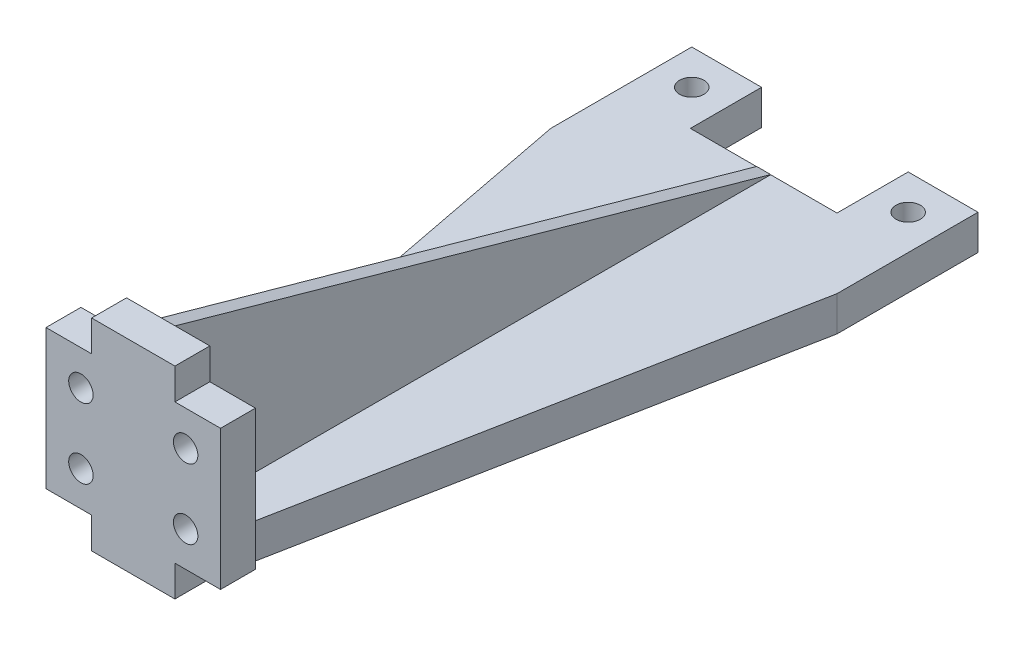
ISO-10303-21;
HEADER;
FILE_DESCRIPTION(('STEP AP214'),'2;1');
FILE_NAME('part.step','',(''),(''),'','','');
FILE_SCHEMA(('AUTOMOTIVE_DESIGN { 1 0 10303 214 1 1 1 1 }'));
ENDSEC;
DATA;
#1=APPLICATION_CONTEXT('core data for automotive mechanical design processes');
#2=APPLICATION_PROTOCOL_DEFINITION('international standard','automotive_design',2000,#1);
#3=PRODUCT_CONTEXT('',#1,'mechanical');
#4=PRODUCT('Part','Part','',(#3));
#5=PRODUCT_RELATED_PRODUCT_CATEGORY('part','',(#4));
#6=PRODUCT_DEFINITION_FORMATION('','',#4);
#7=PRODUCT_DEFINITION_CONTEXT('part definition',#1,'design');
#8=PRODUCT_DEFINITION('design','',#6,#7);
#9=PRODUCT_DEFINITION_SHAPE('','',#8);
#10=(LENGTH_UNIT() NAMED_UNIT(*) SI_UNIT(.MILLI.,.METRE.));
#11=(NAMED_UNIT(*) PLANE_ANGLE_UNIT() SI_UNIT($,.RADIAN.));
#12=(NAMED_UNIT(*) SI_UNIT($,.STERADIAN.) SOLID_ANGLE_UNIT());
#13=UNCERTAINTY_MEASURE_WITH_UNIT(LENGTH_MEASURE(1.E-05),#10,'distance_accuracy_value','');
#14=(GEOMETRIC_REPRESENTATION_CONTEXT(3) GLOBAL_UNCERTAINTY_ASSIGNED_CONTEXT((#13)) GLOBAL_UNIT_ASSIGNED_CONTEXT((#10,
#11,#12)) REPRESENTATION_CONTEXT('',''));
#15=CARTESIAN_POINT('',(0.,0.,0.));
#16=DIRECTION('',(0.,0.,1.));
#17=DIRECTION('',(1.,0.,0.));
#18=AXIS2_PLACEMENT_3D('',#15,#16,#17);
#19=CARTESIAN_POINT('',(25.5,0.,0.));
#20=DIRECTION('',(-0.981875388359621,0.,-0.189527627890089));
#21=DIRECTION('',(-0.189527627890089,0.,0.981875388359621));
#22=AXIS2_PLACEMENT_3D('',#19,#20,#21);
#23=PLANE('',#22);
#24=DIRECTION('',(0.,1.,0.));
#25=VECTOR('',#24,1.);
#26=CARTESIAN_POINT('',(26.4651307596513,-9.01387818865998,-5.));
#27=LINE('',#26,#25);
#28=CARTESIAN_POINT('',(26.4651307596513,0.,-5.));
#29=VERTEX_POINT('',#28);
#30=CARTESIAN_POINT('',(26.4651307596513,4.45,-5.));
#31=VERTEX_POINT('',#30);
#32=EDGE_CURVE('E325',#29,#31,#27,.T.);
#33=ORIENTED_EDGE('',*,*,#32,.F.);
#34=DIRECTION('',(-0.189527627890089,0.,0.981875388359621));
#35=VECTOR('',#34,1.);
#36=CARTESIAN_POINT('',(25.5,0.,0.));
#37=LINE('',#36,#35);
#38=CARTESIAN_POINT('',(41.,0.,-80.3));
#39=VERTEX_POINT('',#38);
#40=EDGE_CURVE('E393',#39,#29,#37,.T.);
#41=ORIENTED_EDGE('',*,*,#40,.F.);
#42=DIRECTION('',(0.,1.,0.));
#43=VECTOR('',#42,1.);
#44=CARTESIAN_POINT('',(41.,0.,-80.3));
#45=LINE('',#44,#43);
#46=CARTESIAN_POINT('',(41.,5.,-80.3));
#47=VERTEX_POINT('',#46);
#48=EDGE_CURVE('E388',#39,#47,#45,.T.);
#49=ORIENTED_EDGE('',*,*,#48,.T.);
#50=DIRECTION('',(-0.189527627890089,0.,0.981875388359621));
#51=VECTOR('',#50,1.);
#52=CARTESIAN_POINT('',(25.5,5.,0.));
#53=LINE('',#52,#51);
#54=CARTESIAN_POINT('',(26.4651307596513,5.,-5.));
#55=VERTEX_POINT('',#54);
#56=EDGE_CURVE('E376',#47,#55,#53,.T.);
#57=ORIENTED_EDGE('',*,*,#56,.T.);
#58=EDGE_CURVE('E330',#31,#55,#27,.T.);
#59=ORIENTED_EDGE('',*,*,#58,.F.);
#60=EDGE_LOOP('',(#33,#41,#49,#57,#59));
#61=FACE_BOUND('',#60,.T.);
#62=ADVANCED_FACE('F41',(#61),#23,.F.);
#63=CARTESIAN_POINT('',(0.,5.,0.));
#64=DIRECTION('',(0.,-1.,0.));
#65=DIRECTION('',(0.,0.,-1.));
#66=AXIS2_PLACEMENT_3D('',#63,#64,#65);
#67=PLANE('',#66);
#68=DIRECTION('',(0.,0.,-1.));
#69=VECTOR('',#68,1.);
#70=CARTESIAN_POINT('',(41.,5.,0.));
#71=LINE('',#70,#69);
#72=CARTESIAN_POINT('',(41.,5.,-100.5));
#73=VERTEX_POINT('',#72);
#74=EDGE_CURVE('E460',#47,#73,#71,.T.);
#75=ORIENTED_EDGE('',*,*,#74,.T.);
#76=DIRECTION('',(-1.,0.,0.));
#77=VECTOR('',#76,1.);
#78=CARTESIAN_POINT('',(0.,5.,-100.5));
#79=LINE('',#78,#77);
#80=CARTESIAN_POINT('',(31.,5.,-100.5));
#81=VERTEX_POINT('',#80);
#82=EDGE_CURVE('E465',#73,#81,#79,.T.);
#83=ORIENTED_EDGE('',*,*,#82,.T.);
#84=DIRECTION('',(0.,0.,-1.));
#85=VECTOR('',#84,1.);
#86=CARTESIAN_POINT('',(31.,5.,-100.5));
#87=LINE('',#86,#85);
#88=CARTESIAN_POINT('',(31.,5.,-90.3));
#89=VERTEX_POINT('',#88);
#90=EDGE_CURVE('E436',#89,#81,#87,.T.);
#91=ORIENTED_EDGE('',*,*,#90,.F.);
#92=DIRECTION('',(1.,0.,0.));
#93=VECTOR('',#92,1.);
#94=CARTESIAN_POINT('',(10.,5.,-90.3));
#95=LINE('',#94,#93);
#96=CARTESIAN_POINT('',(21.5,5.,-90.3));
#97=VERTEX_POINT('',#96);
#98=EDGE_CURVE('E406',#97,#89,#95,.T.);
#99=ORIENTED_EDGE('',*,*,#98,.F.);
#100=DIRECTION('',(0.,0.,-1.));
#101=VECTOR('',#100,1.);
#102=CARTESIAN_POINT('',(21.5,5.,-90.3));
#103=LINE('',#102,#101);
#104=CARTESIAN_POINT('',(21.5,5.,-5.));
#105=VERTEX_POINT('',#104);
#106=EDGE_CURVE('E351',#105,#97,#103,.T.);
#107=ORIENTED_EDGE('',*,*,#106,.F.);
#108=DIRECTION('',(-1.,0.,0.));
#109=VECTOR('',#108,1.);
#110=CARTESIAN_POINT('',(14.5348692403487,5.,-5.));
#111=LINE('',#110,#109);
#112=EDGE_CURVE('E377',#55,#105,#111,.T.);
#113=ORIENTED_EDGE('',*,*,#112,.F.);
#114=ORIENTED_EDGE('',*,*,#56,.F.);
#115=EDGE_LOOP('',(#75,#83,#91,#99,#107,#113,#114));
#116=FACE_BOUND('',#115,.T.);
#117=CARTESIAN_POINT('',(36.,5.,-95.5));
#118=DIRECTION('',(0.,1.,0.));
#119=DIRECTION('',(0.,0.,1.));
#120=AXIS2_PLACEMENT_3D('',#117,#118,#119);
#121=CIRCLE('',#120,1.75);
#122=CARTESIAN_POINT('',(36.,5.,-93.75));
#123=VERTEX_POINT('',#122);
#124=EDGE_CURVE('E392',#123,#123,#121,.T.);
#125=ORIENTED_EDGE('',*,*,#124,.F.);
#126=EDGE_LOOP('',(#125));
#127=FACE_BOUND('',#126,.T.);
#128=ADVANCED_FACE('F506',(#116,#127),#67,.F.);
#129=CARTESIAN_POINT('',(5.,5.,-95.5));
#130=DIRECTION('',(0.,1.,0.));
#131=DIRECTION('',(0.,0.,1.));
#132=AXIS2_PLACEMENT_3D('',#129,#130,#131);
#133=CIRCLE('',#132,1.75);
#134=CARTESIAN_POINT('',(5.,5.,-93.75));
#135=VERTEX_POINT('',#134);
#136=EDGE_CURVE('E407',#135,#135,#133,.T.);
#137=ORIENTED_EDGE('',*,*,#136,.F.);
#138=EDGE_LOOP('',(#137));
#139=FACE_BOUND('',#138,.T.);
#140=DIRECTION('',(0.,0.,1.));
#141=VECTOR('',#140,1.);
#142=CARTESIAN_POINT('',(19.5,5.,-90.3));
#143=LINE('',#142,#141);
#144=CARTESIAN_POINT('',(19.5,5.,-90.3));
#145=VERTEX_POINT('',#144);
#146=CARTESIAN_POINT('',(19.5,5.,-5.));
#147=VERTEX_POINT('',#146);
#148=EDGE_CURVE('E348',#145,#147,#143,.T.);
#149=ORIENTED_EDGE('',*,*,#148,.F.);
#150=CARTESIAN_POINT('',(10.,5.,-90.3));
#151=VERTEX_POINT('',#150);
#152=EDGE_CURVE('E432',#151,#145,#95,.T.);
#153=ORIENTED_EDGE('',*,*,#152,.F.);
#154=DIRECTION('',(0.,0.,1.));
#155=VECTOR('',#154,1.);
#156=CARTESIAN_POINT('',(10.,5.,-100.5));
#157=LINE('',#156,#155);
#158=CARTESIAN_POINT('',(10.,5.,-100.5));
#159=VERTEX_POINT('',#158);
#160=EDGE_CURVE('E423',#159,#151,#157,.T.);
#161=ORIENTED_EDGE('',*,*,#160,.F.);
#162=CARTESIAN_POINT('',(0.,5.,-100.5));
#163=VERTEX_POINT('',#162);
#164=EDGE_CURVE('E464',#159,#163,#79,.T.);
#165=ORIENTED_EDGE('',*,*,#164,.T.);
#166=DIRECTION('',(0.,0.,1.));
#167=VECTOR('',#166,1.);
#168=CARTESIAN_POINT('',(0.,5.,0.));
#169=LINE('',#168,#167);
#170=CARTESIAN_POINT('',(0.,5.,-80.3));
#171=VERTEX_POINT('',#170);
#172=EDGE_CURVE('E456',#163,#171,#169,.T.);
#173=ORIENTED_EDGE('',*,*,#172,.T.);
#174=DIRECTION('',(-0.189527627890089,0.,-0.981875388359621));
#175=VECTOR('',#174,1.);
#176=CARTESIAN_POINT('',(15.5,5.,0.));
#177=LINE('',#176,#175);
#178=CARTESIAN_POINT('',(14.5348692403487,5.,-5.));
#179=VERTEX_POINT('',#178);
#180=EDGE_CURVE('E385',#179,#171,#177,.T.);
#181=ORIENTED_EDGE('',*,*,#180,.F.);
#182=EDGE_CURVE('E368',#147,#179,#111,.T.);
#183=ORIENTED_EDGE('',*,*,#182,.F.);
#184=EDGE_LOOP('',(#149,#153,#161,#165,#173,#181,#183));
#185=FACE_BOUND('',#184,.T.);
#186=ADVANCED_FACE('F548',(#139,#185),#67,.F.);
#187=CARTESIAN_POINT('',(14.5348692403487,28.9,-5.));
#188=DIRECTION('',(0.,0.,1.));
#189=DIRECTION('',(1.,0.,0.));
#190=AXIS2_PLACEMENT_3D('',#187,#188,#189);
#191=PLANE('',#190);
#192=CARTESIAN_POINT('',(28.,19.45,-5.));
#193=DIRECTION('',(0.,0.,1.));
#194=DIRECTION('',(1.,0.,0.));
#195=AXIS2_PLACEMENT_3D('',#192,#193,#194);
#196=CIRCLE('',#195,1.75);
#197=CARTESIAN_POINT('',(29.75,19.45,-5.));
#198=VERTEX_POINT('',#197);
#199=EDGE_CURVE('E239',#198,#198,#196,.T.);
#200=ORIENTED_EDGE('',*,*,#199,.T.);
#201=EDGE_LOOP('',(#200));
#202=FACE_BOUND('',#201,.T.);
#203=CARTESIAN_POINT('',(28.,9.45,-5.));
#204=DIRECTION('',(0.,0.,1.));
#205=DIRECTION('',(1.,0.,0.));
#206=AXIS2_PLACEMENT_3D('',#203,#204,#205);
#207=CIRCLE('',#206,1.75);
#208=CARTESIAN_POINT('',(29.75,9.45,-5.));
#209=VERTEX_POINT('',#208);
#210=EDGE_CURVE('E922',#209,#209,#207,.T.);
#211=ORIENTED_EDGE('',*,*,#210,.T.);
#212=EDGE_LOOP('',(#211));
#213=FACE_BOUND('',#212,.T.);
#214=DIRECTION('',(0.,1.,0.));
#215=VECTOR('',#214,1.);
#216=CARTESIAN_POINT('',(33.,-9.01387818865998,-5.));
#217=LINE('',#216,#215);
#218=CARTESIAN_POINT('',(33.,4.45,-5.));
#219=VERTEX_POINT('',#218);
#220=CARTESIAN_POINT('',(33.,24.45,-5.));
#221=VERTEX_POINT('',#220);
#222=EDGE_CURVE('E331',#219,#221,#217,.T.);
#223=ORIENTED_EDGE('',*,*,#222,.F.);
#224=DIRECTION('',(1.,0.,0.));
#225=VECTOR('',#224,1.);
#226=CARTESIAN_POINT('',(26.4651307596513,4.45,-5.));
#227=LINE('',#226,#225);
#228=EDGE_CURVE('E57',#31,#219,#227,.T.);
#229=ORIENTED_EDGE('',*,*,#228,.F.);
#230=ORIENTED_EDGE('',*,*,#58,.T.);
#231=ORIENTED_EDGE('',*,*,#112,.T.);
#232=DIRECTION('',(0.,-1.,0.));
#233=VECTOR('',#232,1.);
#234=CARTESIAN_POINT('',(21.5,114.223443437311,-5.));
#235=LINE('',#234,#233);
#236=CARTESIAN_POINT('',(21.5,28.9,-5.));
#237=VERTEX_POINT('',#236);
#238=EDGE_CURVE('E361',#237,#105,#235,.T.);
#239=ORIENTED_EDGE('',*,*,#238,.F.);
#240=DIRECTION('',(-1.,0.,0.));
#241=VECTOR('',#240,1.);
#242=CARTESIAN_POINT('',(14.5348692403487,28.9,-5.));
#243=LINE('',#242,#241);
#244=CARTESIAN_POINT('',(26.4651307596513,28.9,-5.));
#245=VERTEX_POINT('',#244);
#246=EDGE_CURVE('E369',#245,#237,#243,.T.);
#247=ORIENTED_EDGE('',*,*,#246,.F.);
#248=DIRECTION('',(0.,1.,0.));
#249=VECTOR('',#248,1.);
#250=CARTESIAN_POINT('',(26.4651307596513,28.9,-5.));
#251=LINE('',#250,#249);
#252=CARTESIAN_POINT('',(26.4651307596513,24.45,-5.));
#253=VERTEX_POINT('',#252);
#254=EDGE_CURVE('E234',#253,#245,#251,.T.);
#255=ORIENTED_EDGE('',*,*,#254,.F.);
#256=DIRECTION('',(-1.,0.,0.));
#257=VECTOR('',#256,1.);
#258=CARTESIAN_POINT('',(33.,24.45,-5.));
#259=LINE('',#258,#257);
#260=EDGE_CURVE('E211',#221,#253,#259,.T.);
#261=ORIENTED_EDGE('',*,*,#260,.F.);
#262=EDGE_LOOP('',(#223,#229,#230,#231,#239,#247,#255,#261));
#263=FACE_BOUND('',#262,.T.);
#264=ADVANCED_FACE('F571',(#202,#213,#263),#191,.F.);
#265=CARTESIAN_POINT('',(13.,9.45,-5.));
#266=DIRECTION('',(0.,0.,1.));
#267=DIRECTION('',(1.,0.,0.));
#268=AXIS2_PLACEMENT_3D('',#265,#266,#267);
#269=CIRCLE('',#268,1.75);
#270=CARTESIAN_POINT('',(14.75,9.45,-5.));
#271=VERTEX_POINT('',#270);
#272=EDGE_CURVE('E937',#271,#271,#269,.T.);
#273=ORIENTED_EDGE('',*,*,#272,.T.);
#274=EDGE_LOOP('',(#273));
#275=FACE_BOUND('',#274,.T.);
#276=CARTESIAN_POINT('',(13.,19.45,-5.));
#277=DIRECTION('',(0.,0.,1.));
#278=DIRECTION('',(1.,0.,0.));
#279=AXIS2_PLACEMENT_3D('',#276,#277,#278);
#280=CIRCLE('',#279,1.75);
#281=CARTESIAN_POINT('',(14.75,19.45,-5.));
#282=VERTEX_POINT('',#281);
#283=EDGE_CURVE('E938',#282,#282,#280,.T.);
#284=ORIENTED_EDGE('',*,*,#283,.T.);
#285=EDGE_LOOP('',(#284));
#286=FACE_BOUND('',#285,.T.);
#287=DIRECTION('',(0.,1.,0.));
#288=VECTOR('',#287,1.);
#289=CARTESIAN_POINT('',(8.00000000000001,-9.01387818865998,-5.));
#290=LINE('',#289,#288);
#291=CARTESIAN_POINT('',(8.00000000000001,4.45,-5.));
#292=VERTEX_POINT('',#291);
#293=CARTESIAN_POINT('',(8.00000000000001,24.45,-5.));
#294=VERTEX_POINT('',#293);
#295=EDGE_CURVE('E307',#292,#294,#290,.T.);
#296=ORIENTED_EDGE('',*,*,#295,.T.);
#297=DIRECTION('',(-1.,0.,0.));
#298=VECTOR('',#297,1.);
#299=CARTESIAN_POINT('',(8.00000000000001,24.45,-5.));
#300=LINE('',#299,#298);
#301=CARTESIAN_POINT('',(14.5348692403487,24.45,-5.));
#302=VERTEX_POINT('',#301);
#303=EDGE_CURVE('E273',#302,#294,#300,.T.);
#304=ORIENTED_EDGE('',*,*,#303,.F.);
#305=DIRECTION('',(0.,-1.,0.));
#306=VECTOR('',#305,1.);
#307=CARTESIAN_POINT('',(14.5348692403487,28.9,-5.));
#308=LINE('',#307,#306);
#309=CARTESIAN_POINT('',(14.5348692403487,28.9,-5.));
#310=VERTEX_POINT('',#309);
#311=EDGE_CURVE('E245',#310,#302,#308,.T.);
#312=ORIENTED_EDGE('',*,*,#311,.F.);
#313=CARTESIAN_POINT('',(19.5,28.9,-5.));
#314=VERTEX_POINT('',#313);
#315=EDGE_CURVE('E373',#314,#310,#243,.T.);
#316=ORIENTED_EDGE('',*,*,#315,.F.);
#317=DIRECTION('',(0.,-1.,0.));
#318=VECTOR('',#317,1.);
#319=CARTESIAN_POINT('',(19.5,114.223443437311,-5.));
#320=LINE('',#319,#318);
#321=EDGE_CURVE('E364',#314,#147,#320,.T.);
#322=ORIENTED_EDGE('',*,*,#321,.T.);
#323=ORIENTED_EDGE('',*,*,#182,.T.);
#324=DIRECTION('',(0.,1.,0.));
#325=VECTOR('',#324,1.);
#326=CARTESIAN_POINT('',(14.5348692403487,-9.01387818865998,-5.));
#327=LINE('',#326,#325);
#328=CARTESIAN_POINT('',(14.5348692403487,4.45,-5.));
#329=VERTEX_POINT('',#328);
#330=EDGE_CURVE('E317',#329,#179,#327,.T.);
#331=ORIENTED_EDGE('',*,*,#330,.F.);
#332=DIRECTION('',(1.,0.,0.));
#333=VECTOR('',#332,1.);
#334=CARTESIAN_POINT('',(8.00000000000001,4.45,-5.));
#335=LINE('',#334,#333);
#336=EDGE_CURVE('E262',#292,#329,#335,.T.);
#337=ORIENTED_EDGE('',*,*,#336,.F.);
#338=EDGE_LOOP('',(#296,#304,#312,#316,#322,#323,#331,#337));
#339=FACE_BOUND('',#338,.T.);
#340=ADVANCED_FACE('F549',(#275,#286,#339),#191,.F.);
#341=CARTESIAN_POINT('',(0.,5.,-100.5));
#342=DIRECTION('',(0.,0.,1.));
#343=DIRECTION('',(1.,0.,0.));
#344=AXIS2_PLACEMENT_3D('',#341,#342,#343);
#345=PLANE('',#344);
#346=ORIENTED_EDGE('',*,*,#164,.F.);
#347=DIRECTION('',(0.,1.,0.));
#348=VECTOR('',#347,1.);
#349=CARTESIAN_POINT('',(10.,0.,-100.5));
#350=LINE('',#349,#348);
#351=CARTESIAN_POINT('',(10.,0.,-100.5));
#352=VERTEX_POINT('',#351);
#353=EDGE_CURVE('E446',#352,#159,#350,.T.);
#354=ORIENTED_EDGE('',*,*,#353,.F.);
#355=DIRECTION('',(-1.,0.,0.));
#356=VECTOR('',#355,1.);
#357=CARTESIAN_POINT('',(0.,0.,-100.5));
#358=LINE('',#357,#356);
#359=CARTESIAN_POINT('',(0.,0.,-100.5));
#360=VERTEX_POINT('',#359);
#361=EDGE_CURVE('E480',#352,#360,#358,.T.);
#362=ORIENTED_EDGE('',*,*,#361,.T.);
#363=DIRECTION('',(0.,-1.,0.));
#364=VECTOR('',#363,1.);
#365=CARTESIAN_POINT('',(0.,5.,-100.5));
#366=LINE('',#365,#364);
#367=EDGE_CURVE('E469',#163,#360,#366,.T.);
#368=ORIENTED_EDGE('',*,*,#367,.F.);
#369=EDGE_LOOP('',(#346,#354,#362,#368));
#370=FACE_BOUND('',#369,.T.);
#371=ADVANCED_FACE('F563',(#370),#345,.F.);
#372=CARTESIAN_POINT('',(0.,5.,0.));
#373=DIRECTION('',(1.,0.,0.));
#374=DIRECTION('',(0.,0.,-1.));
#375=AXIS2_PLACEMENT_3D('',#372,#373,#374);
#376=PLANE('',#375);
#377=DIRECTION('',(0.,0.,1.));
#378=VECTOR('',#377,1.);
#379=CARTESIAN_POINT('',(0.,0.,0.));
#380=LINE('',#379,#378);
#381=CARTESIAN_POINT('',(0.,0.,-80.3));
#382=VERTEX_POINT('',#381);
#383=EDGE_CURVE('E445',#360,#382,#380,.T.);
#384=ORIENTED_EDGE('',*,*,#383,.T.);
#385=DIRECTION('',(0.,1.,0.));
#386=VECTOR('',#385,1.);
#387=CARTESIAN_POINT('',(0.,0.,-80.3));
#388=LINE('',#387,#386);
#389=EDGE_CURVE('E384',#382,#171,#388,.T.);
#390=ORIENTED_EDGE('',*,*,#389,.T.);
#391=ORIENTED_EDGE('',*,*,#172,.F.);
#392=ORIENTED_EDGE('',*,*,#367,.T.);
#393=EDGE_LOOP('',(#384,#390,#391,#392));
#394=FACE_BOUND('',#393,.T.);
#395=ADVANCED_FACE('F43',(#394),#376,.F.);
#396=CARTESIAN_POINT('',(0.,5.,0.));
#397=DIRECTION('',(0.,0.,-1.));
#398=DIRECTION('',(-1.,0.,0.));
#399=AXIS2_PLACEMENT_3D('',#396,#397,#398);
#400=PLANE('',#399);
#401=CARTESIAN_POINT('',(28.,19.45,0.));
#402=DIRECTION('',(0.,0.,1.));
#403=DIRECTION('',(1.,0.,0.));
#404=AXIS2_PLACEMENT_3D('',#401,#402,#403);
#405=CIRCLE('',#404,1.75);
#406=CARTESIAN_POINT('',(29.75,19.45,0.));
#407=VERTEX_POINT('',#406);
#408=EDGE_CURVE('E950',#407,#407,#405,.T.);
#409=ORIENTED_EDGE('',*,*,#408,.F.);
#410=EDGE_LOOP('',(#409));
#411=FACE_BOUND('',#410,.T.);
#412=CARTESIAN_POINT('',(13.,9.45,0.));
#413=DIRECTION('',(0.,0.,1.));
#414=DIRECTION('',(1.,0.,0.));
#415=AXIS2_PLACEMENT_3D('',#412,#413,#414);
#416=CIRCLE('',#415,1.75);
#417=CARTESIAN_POINT('',(14.75,9.45,0.));
#418=VERTEX_POINT('',#417);
#419=EDGE_CURVE('E951',#418,#418,#416,.T.);
#420=ORIENTED_EDGE('',*,*,#419,.F.);
#421=EDGE_LOOP('',(#420));
#422=FACE_BOUND('',#421,.T.);
#423=CARTESIAN_POINT('',(28.,9.45,0.));
#424=DIRECTION('',(0.,0.,1.));
#425=DIRECTION('',(1.,0.,0.));
#426=AXIS2_PLACEMENT_3D('',#423,#424,#425);
#427=CIRCLE('',#426,1.75);
#428=CARTESIAN_POINT('',(29.75,9.45,0.));
#429=VERTEX_POINT('',#428);
#430=EDGE_CURVE('E955',#429,#429,#427,.T.);
#431=ORIENTED_EDGE('',*,*,#430,.F.);
#432=EDGE_LOOP('',(#431));
#433=FACE_BOUND('',#432,.T.);
#434=CARTESIAN_POINT('',(13.,19.45,0.));
#435=DIRECTION('',(0.,0.,1.));
#436=DIRECTION('',(1.,0.,0.));
#437=AXIS2_PLACEMENT_3D('',#434,#435,#436);
#438=CIRCLE('',#437,1.75);
#439=CARTESIAN_POINT('',(14.75,19.45,0.));
#440=VERTEX_POINT('',#439);
#441=EDGE_CURVE('E944',#440,#440,#438,.T.);
#442=ORIENTED_EDGE('',*,*,#441,.F.);
#443=EDGE_LOOP('',(#442));
#444=FACE_BOUND('',#443,.T.);
#445=DIRECTION('',(0.,1.,0.));
#446=VECTOR('',#445,1.);
#447=CARTESIAN_POINT('',(26.4651307596513,0.,0.));
#448=LINE('',#447,#446);
#449=CARTESIAN_POINT('',(26.4651307596513,0.,0.));
#450=VERTEX_POINT('',#449);
#451=CARTESIAN_POINT('',(26.4651307596513,4.45,0.));
#452=VERTEX_POINT('',#451);
#453=EDGE_CURVE('E249',#450,#452,#448,.T.);
#454=ORIENTED_EDGE('',*,*,#453,.T.);
#455=DIRECTION('',(1.,0.,0.));
#456=VECTOR('',#455,1.);
#457=CARTESIAN_POINT('',(26.4651307596513,4.45,0.));
#458=LINE('',#457,#456);
#459=CARTESIAN_POINT('',(33.,4.45,0.));
#460=VERTEX_POINT('',#459);
#461=EDGE_CURVE('E252',#452,#460,#458,.T.);
#462=ORIENTED_EDGE('',*,*,#461,.T.);
#463=DIRECTION('',(0.,1.,0.));
#464=VECTOR('',#463,1.);
#465=CARTESIAN_POINT('',(33.,-9.01387818865998,0.));
#466=LINE('',#465,#464);
#467=CARTESIAN_POINT('',(33.,24.45,0.));
#468=VERTEX_POINT('',#467);
#469=EDGE_CURVE('E232',#460,#468,#466,.T.);
#470=ORIENTED_EDGE('',*,*,#469,.T.);
#471=DIRECTION('',(-1.,0.,0.));
#472=VECTOR('',#471,1.);
#473=CARTESIAN_POINT('',(33.,24.45,0.));
#474=LINE('',#473,#472);
#475=CARTESIAN_POINT('',(26.4651307596513,24.45,0.));
#476=VERTEX_POINT('',#475);
#477=EDGE_CURVE('E65',#468,#476,#474,.T.);
#478=ORIENTED_EDGE('',*,*,#477,.T.);
#479=DIRECTION('',(0.,1.,0.));
#480=VECTOR('',#479,1.);
#481=CARTESIAN_POINT('',(26.4651307596513,28.9,0.));
#482=LINE('',#481,#480);
#483=CARTESIAN_POINT('',(26.4651307596513,28.9,0.));
#484=VERTEX_POINT('',#483);
#485=EDGE_CURVE('E219',#476,#484,#482,.T.);
#486=ORIENTED_EDGE('',*,*,#485,.T.);
#487=DIRECTION('',(1.,0.,0.));
#488=VECTOR('',#487,1.);
#489=CARTESIAN_POINT('',(25.5,28.9,0.));
#490=LINE('',#489,#488);
#491=CARTESIAN_POINT('',(14.5348692403487,28.9,0.));
#492=VERTEX_POINT('',#491);
#493=EDGE_CURVE('E372',#492,#484,#490,.T.);
#494=ORIENTED_EDGE('',*,*,#493,.F.);
#495=DIRECTION('',(0.,-1.,0.));
#496=VECTOR('',#495,1.);
#497=CARTESIAN_POINT('',(14.5348692403487,28.9,0.));
#498=LINE('',#497,#496);
#499=CARTESIAN_POINT('',(14.5348692403487,24.45,0.));
#500=VERTEX_POINT('',#499);
#501=EDGE_CURVE('E268',#492,#500,#498,.T.);
#502=ORIENTED_EDGE('',*,*,#501,.T.);
#503=DIRECTION('',(-1.,0.,0.));
#504=VECTOR('',#503,1.);
#505=CARTESIAN_POINT('',(8.00000000000001,24.45,0.));
#506=LINE('',#505,#504);
#507=CARTESIAN_POINT('',(8.00000000000001,24.45,0.));
#508=VERTEX_POINT('',#507);
#509=EDGE_CURVE('E272',#500,#508,#506,.T.);
#510=ORIENTED_EDGE('',*,*,#509,.T.);
#511=DIRECTION('',(0.,1.,0.));
#512=VECTOR('',#511,1.);
#513=CARTESIAN_POINT('',(8.00000000000001,-9.01387818865998,0.));
#514=LINE('',#513,#512);
#515=CARTESIAN_POINT('',(8.00000000000001,4.45,0.));
#516=VERTEX_POINT('',#515);
#517=EDGE_CURVE('E313',#516,#508,#514,.T.);
#518=ORIENTED_EDGE('',*,*,#517,.F.);
#519=DIRECTION('',(1.,0.,0.));
#520=VECTOR('',#519,1.);
#521=CARTESIAN_POINT('',(8.00000000000001,4.45,0.));
#522=LINE('',#521,#520);
#523=CARTESIAN_POINT('',(14.5348692403487,4.45,0.));
#524=VERTEX_POINT('',#523);
#525=EDGE_CURVE('E291',#516,#524,#522,.T.);
#526=ORIENTED_EDGE('',*,*,#525,.T.);
#527=DIRECTION('',(0.,-1.,0.));
#528=VECTOR('',#527,1.);
#529=CARTESIAN_POINT('',(14.5348692403487,4.45,0.));
#530=LINE('',#529,#528);
#531=CARTESIAN_POINT('',(14.5348692403487,0.,0.));
#532=VERTEX_POINT('',#531);
#533=EDGE_CURVE('E295',#524,#532,#530,.T.);
#534=ORIENTED_EDGE('',*,*,#533,.T.);
#535=DIRECTION('',(1.,0.,0.));
#536=VECTOR('',#535,1.);
#537=CARTESIAN_POINT('',(0.,0.,0.));
#538=LINE('',#537,#536);
#539=EDGE_CURVE('E473',#532,#450,#538,.T.);
#540=ORIENTED_EDGE('',*,*,#539,.T.);
#541=EDGE_LOOP('',(#454,#462,#470,#478,#486,#494,#502,#510,#518,#526,#534,#540));
#542=FACE_BOUND('',#541,.T.);
#543=ADVANCED_FACE('F229',(#411,#422,#433,#444,#542),#400,.F.);
#544=CARTESIAN_POINT('',(41.,5.,0.));
#545=DIRECTION('',(-1.,0.,0.));
#546=DIRECTION('',(0.,0.,1.));
#547=AXIS2_PLACEMENT_3D('',#544,#545,#546);
#548=PLANE('',#547);
#549=ORIENTED_EDGE('',*,*,#74,.F.);
#550=ORIENTED_EDGE('',*,*,#48,.F.);
#551=DIRECTION('',(0.,0.,-1.));
#552=VECTOR('',#551,1.);
#553=CARTESIAN_POINT('',(41.,0.,0.));
#554=LINE('',#553,#552);
#555=CARTESIAN_POINT('',(41.,0.,-100.5));
#556=VERTEX_POINT('',#555);
#557=EDGE_CURVE('E477',#39,#556,#554,.T.);
#558=ORIENTED_EDGE('',*,*,#557,.T.);
#559=DIRECTION('',(0.,-1.,0.));
#560=VECTOR('',#559,1.);
#561=CARTESIAN_POINT('',(41.,5.,-100.5));
#562=LINE('',#561,#560);
#563=EDGE_CURVE('E50',#73,#556,#562,.T.);
#564=ORIENTED_EDGE('',*,*,#563,.F.);
#565=EDGE_LOOP('',(#549,#550,#558,#564));
#566=FACE_BOUND('',#565,.T.);
#567=ADVANCED_FACE('F512',(#566),#548,.F.);
#568=CARTESIAN_POINT('',(31.,0.,-100.5));
#569=VERTEX_POINT('',#568);
#570=EDGE_CURVE('E461',#556,#569,#358,.T.);
#571=ORIENTED_EDGE('',*,*,#570,.T.);
#572=DIRECTION('',(0.,1.,0.));
#573=VECTOR('',#572,1.);
#574=CARTESIAN_POINT('',(31.,0.,-100.5));
#575=LINE('',#574,#573);
#576=EDGE_CURVE('E449',#569,#81,#575,.T.);
#577=ORIENTED_EDGE('',*,*,#576,.T.);
#578=ORIENTED_EDGE('',*,*,#82,.F.);
#579=ORIENTED_EDGE('',*,*,#563,.T.);
#580=EDGE_LOOP('',(#571,#577,#578,#579));
#581=FACE_BOUND('',#580,.T.);
#582=ADVANCED_FACE('F492',(#581),#345,.F.);
#583=CARTESIAN_POINT('',(0.,0.,0.));
#584=DIRECTION('',(0.,-1.,0.));
#585=DIRECTION('',(0.,0.,-1.));
#586=AXIS2_PLACEMENT_3D('',#583,#584,#585);
#587=PLANE('',#586);
#588=DIRECTION('',(0.,0.,-1.));
#589=VECTOR('',#588,1.);
#590=CARTESIAN_POINT('',(26.4651307596513,0.,0.));
#591=LINE('',#590,#589);
#592=EDGE_CURVE('E255',#450,#29,#591,.T.);
#593=ORIENTED_EDGE('',*,*,#592,.F.);
#594=ORIENTED_EDGE('',*,*,#539,.F.);
#595=DIRECTION('',(0.,0.,-1.));
#596=VECTOR('',#595,1.);
#597=CARTESIAN_POINT('',(14.5348692403487,0.,0.));
#598=LINE('',#597,#596);
#599=CARTESIAN_POINT('',(14.5348692403487,0.,-5.));
#600=VERTEX_POINT('',#599);
#601=EDGE_CURVE('E303',#532,#600,#598,.T.);
#602=ORIENTED_EDGE('',*,*,#601,.T.);
#603=DIRECTION('',(-0.189527627890089,0.,-0.981875388359621));
#604=VECTOR('',#603,1.);
#605=CARTESIAN_POINT('',(15.5,0.,0.));
#606=LINE('',#605,#604);
#607=EDGE_CURVE('E381',#600,#382,#606,.T.);
#608=ORIENTED_EDGE('',*,*,#607,.T.);
#609=ORIENTED_EDGE('',*,*,#383,.F.);
#610=ORIENTED_EDGE('',*,*,#361,.F.);
#611=DIRECTION('',(0.,0.,1.));
#612=VECTOR('',#611,1.);
#613=CARTESIAN_POINT('',(10.,0.,-100.5));
#614=LINE('',#613,#612);
#615=CARTESIAN_POINT('',(10.,0.,-90.3));
#616=VERTEX_POINT('',#615);
#617=EDGE_CURVE('E427',#352,#616,#614,.T.);
#618=ORIENTED_EDGE('',*,*,#617,.T.);
#619=DIRECTION('',(1.,0.,0.));
#620=VECTOR('',#619,1.);
#621=CARTESIAN_POINT('',(10.,0.,-90.3));
#622=LINE('',#621,#620);
#623=CARTESIAN_POINT('',(31.,0.,-90.3));
#624=VERTEX_POINT('',#623);
#625=EDGE_CURVE('E418',#616,#624,#622,.T.);
#626=ORIENTED_EDGE('',*,*,#625,.T.);
#627=DIRECTION('',(0.,0.,-1.));
#628=VECTOR('',#627,1.);
#629=CARTESIAN_POINT('',(31.,0.,-100.5));
#630=LINE('',#629,#628);
#631=EDGE_CURVE('E422',#624,#569,#630,.T.);
#632=ORIENTED_EDGE('',*,*,#631,.T.);
#633=ORIENTED_EDGE('',*,*,#570,.F.);
#634=ORIENTED_EDGE('',*,*,#557,.F.);
#635=ORIENTED_EDGE('',*,*,#40,.T.);
#636=EDGE_LOOP('',(#593,#594,#602,#608,#609,#610,#618,#626,#632,#633,#634,#635));
#637=FACE_BOUND('',#636,.T.);
#638=CARTESIAN_POINT('',(5.,0.,-95.5));
#639=DIRECTION('',(0.,1.,0.));
#640=DIRECTION('',(0.,0.,1.));
#641=AXIS2_PLACEMENT_3D('',#638,#639,#640);
#642=CIRCLE('',#641,1.75);
#643=CARTESIAN_POINT('',(5.,0.,-93.75));
#644=VERTEX_POINT('',#643);
#645=EDGE_CURVE('E402',#644,#644,#642,.T.);
#646=ORIENTED_EDGE('',*,*,#645,.T.);
#647=EDGE_LOOP('',(#646));
#648=FACE_BOUND('',#647,.T.);
#649=CARTESIAN_POINT('',(36.,0.,-95.5));
#650=DIRECTION('',(0.,1.,0.));
#651=DIRECTION('',(0.,0.,1.));
#652=AXIS2_PLACEMENT_3D('',#649,#650,#651);
#653=CIRCLE('',#652,1.75);
#654=CARTESIAN_POINT('',(36.,0.,-93.75));
#655=VERTEX_POINT('',#654);
#656=EDGE_CURVE('E411',#655,#655,#653,.T.);
#657=ORIENTED_EDGE('',*,*,#656,.T.);
#658=EDGE_LOOP('',(#657));
#659=FACE_BOUND('',#658,.T.);
#660=ADVANCED_FACE('F498',(#637,#648,#659),#587,.T.);
#661=CARTESIAN_POINT('',(10.,0.,-90.3));
#662=DIRECTION('',(0.,0.,1.));
#663=DIRECTION('',(1.,0.,0.));
#664=AXIS2_PLACEMENT_3D('',#661,#662,#663);
#665=PLANE('',#664);
#666=DIRECTION('',(0.,-1.,0.));
#667=VECTOR('',#666,1.);
#668=CARTESIAN_POINT('',(19.5,114.223443437311,-90.3));
#669=LINE('',#668,#667);
#670=CARTESIAN_POINT('',(19.5,5.02798594847776,-90.3));
#671=VERTEX_POINT('',#670);
#672=EDGE_CURVE('E355',#671,#145,#669,.T.);
#673=ORIENTED_EDGE('',*,*,#672,.F.);
#674=DIRECTION('',(1.,0.,0.));
#675=VECTOR('',#674,1.);
#676=CARTESIAN_POINT('',(10.,5.02798594847775,-90.3));
#677=LINE('',#676,#675);
#678=CARTESIAN_POINT('',(21.5,5.02798594847776,-90.3));
#679=VERTEX_POINT('',#678);
#680=EDGE_CURVE('E344',#671,#679,#677,.T.);
#681=ORIENTED_EDGE('',*,*,#680,.T.);
#682=DIRECTION('',(0.,-1.,0.));
#683=VECTOR('',#682,1.);
#684=CARTESIAN_POINT('',(21.5,114.223443437311,-90.3));
#685=LINE('',#684,#683);
#686=EDGE_CURVE('E358',#679,#97,#685,.T.);
#687=ORIENTED_EDGE('',*,*,#686,.T.);
#688=ORIENTED_EDGE('',*,*,#98,.T.);
#689=DIRECTION('',(0.,1.,0.));
#690=VECTOR('',#689,1.);
#691=CARTESIAN_POINT('',(31.,0.,-90.3));
#692=LINE('',#691,#690);
#693=EDGE_CURVE('E431',#624,#89,#692,.T.);
#694=ORIENTED_EDGE('',*,*,#693,.F.);
#695=ORIENTED_EDGE('',*,*,#625,.F.);
#696=DIRECTION('',(0.,1.,0.));
#697=VECTOR('',#696,1.);
#698=CARTESIAN_POINT('',(10.,0.,-90.3));
#699=LINE('',#698,#697);
#700=EDGE_CURVE('E442',#616,#151,#699,.T.);
#701=ORIENTED_EDGE('',*,*,#700,.T.);
#702=ORIENTED_EDGE('',*,*,#152,.T.);
#703=EDGE_LOOP('',(#673,#681,#687,#688,#694,#695,#701,#702));
#704=FACE_BOUND('',#703,.T.);
#705=ADVANCED_FACE('F559',(#704),#665,.F.);
#706=CARTESIAN_POINT('',(10.,0.,-100.5));
#707=DIRECTION('',(-1.,0.,0.));
#708=DIRECTION('',(0.,0.,1.));
#709=AXIS2_PLACEMENT_3D('',#706,#707,#708);
#710=PLANE('',#709);
#711=ORIENTED_EDGE('',*,*,#160,.T.);
#712=ORIENTED_EDGE('',*,*,#700,.F.);
#713=ORIENTED_EDGE('',*,*,#617,.F.);
#714=ORIENTED_EDGE('',*,*,#353,.T.);
#715=EDGE_LOOP('',(#711,#712,#713,#714));
#716=FACE_BOUND('',#715,.T.);
#717=ADVANCED_FACE('F561',(#716),#710,.F.);
#718=CARTESIAN_POINT('',(31.,0.,-100.5));
#719=DIRECTION('',(1.,0.,0.));
#720=DIRECTION('',(0.,0.,-1.));
#721=AXIS2_PLACEMENT_3D('',#718,#719,#720);
#722=PLANE('',#721);
#723=ORIENTED_EDGE('',*,*,#90,.T.);
#724=ORIENTED_EDGE('',*,*,#576,.F.);
#725=ORIENTED_EDGE('',*,*,#631,.F.);
#726=ORIENTED_EDGE('',*,*,#693,.T.);
#727=EDGE_LOOP('',(#723,#724,#725,#726));
#728=FACE_BOUND('',#727,.T.);
#729=ADVANCED_FACE('F503',(#728),#722,.F.);
#730=CARTESIAN_POINT('',(36.,0.,-95.5));
#731=DIRECTION('',(0.,1.,0.));
#732=DIRECTION('',(0.,0.,1.));
#733=AXIS2_PLACEMENT_3D('',#730,#731,#732);
#734=CYLINDRICAL_SURFACE('',#733,1.75);
#735=ORIENTED_EDGE('',*,*,#656,.F.);
#736=EDGE_LOOP('',(#735));
#737=FACE_BOUND('',#736,.T.);
#738=ORIENTED_EDGE('',*,*,#124,.T.);
#739=EDGE_LOOP('',(#738));
#740=FACE_BOUND('',#739,.T.);
#741=ADVANCED_FACE('F588',(#737,#740),#734,.F.);
#742=CARTESIAN_POINT('',(5.,0.,-95.5));
#743=DIRECTION('',(0.,1.,0.));
#744=DIRECTION('',(0.,0.,1.));
#745=AXIS2_PLACEMENT_3D('',#742,#743,#744);
#746=CYLINDRICAL_SURFACE('',#745,1.75);
#747=ORIENTED_EDGE('',*,*,#645,.F.);
#748=EDGE_LOOP('',(#747));
#749=FACE_BOUND('',#748,.T.);
#750=ORIENTED_EDGE('',*,*,#136,.T.);
#751=EDGE_LOOP('',(#750));
#752=FACE_BOUND('',#751,.T.);
#753=ADVANCED_FACE('F585',(#749,#752),#746,.F.);
#754=CARTESIAN_POINT('',(15.5,0.,0.));
#755=DIRECTION('',(0.981875388359621,0.,-0.189527627890089));
#756=DIRECTION('',(-0.189527627890089,0.,-0.981875388359621));
#757=AXIS2_PLACEMENT_3D('',#754,#755,#756);
#758=PLANE('',#757);
#759=ORIENTED_EDGE('',*,*,#607,.F.);
#760=EDGE_CURVE('E321',#600,#329,#327,.T.);
#761=ORIENTED_EDGE('',*,*,#760,.T.);
#762=ORIENTED_EDGE('',*,*,#330,.T.);
#763=ORIENTED_EDGE('',*,*,#180,.T.);
#764=ORIENTED_EDGE('',*,*,#389,.F.);
#765=EDGE_LOOP('',(#759,#761,#762,#763,#764));
#766=FACE_BOUND('',#765,.T.);
#767=ADVANCED_FACE('F526',(#766),#758,.F.);
#768=CARTESIAN_POINT('',(0.,28.9,0.));
#769=DIRECTION('',(0.,-1.,0.));
#770=DIRECTION('',(0.,0.,-1.));
#771=AXIS2_PLACEMENT_3D('',#768,#769,#770);
#772=PLANE('',#771);
#773=ORIENTED_EDGE('',*,*,#315,.T.);
#774=DIRECTION('',(0.,0.,-1.));
#775=VECTOR('',#774,1.);
#776=CARTESIAN_POINT('',(14.5348692403487,28.9,0.));
#777=LINE('',#776,#775);
#778=EDGE_CURVE('E277',#492,#310,#777,.T.);
#779=ORIENTED_EDGE('',*,*,#778,.F.);
#780=ORIENTED_EDGE('',*,*,#493,.T.);
#781=DIRECTION('',(0.,0.,-1.));
#782=VECTOR('',#781,1.);
#783=CARTESIAN_POINT('',(26.4651307596513,28.9,0.));
#784=LINE('',#783,#782);
#785=EDGE_CURVE('E215',#484,#245,#784,.T.);
#786=ORIENTED_EDGE('',*,*,#785,.T.);
#787=ORIENTED_EDGE('',*,*,#246,.T.);
#788=DIRECTION('',(-1.,0.,0.));
#789=VECTOR('',#788,1.);
#790=CARTESIAN_POINT('',(41.,28.9,-5.));
#791=LINE('',#790,#789);
#792=EDGE_CURVE('E329',#237,#314,#791,.T.);
#793=ORIENTED_EDGE('',*,*,#792,.T.);
#794=EDGE_LOOP('',(#773,#779,#780,#786,#787,#793));
#795=FACE_BOUND('',#794,.T.);
#796=ADVANCED_FACE('F633',(#795),#772,.F.);
#797=CARTESIAN_POINT('',(21.5,114.223443437311,-90.3));
#798=DIRECTION('',(-1.,0.,0.));
#799=DIRECTION('',(0.,0.,1.));
#800=AXIS2_PLACEMENT_3D('',#797,#798,#799);
#801=PLANE('',#800);
#802=ORIENTED_EDGE('',*,*,#686,.F.);
#803=DIRECTION('',(0.,0.269504444707931,0.96299914552541));
#804=VECTOR('',#803,1.);
#805=CARTESIAN_POINT('',(21.5,12.959140926206,-61.9602244728875));
#806=LINE('',#805,#804);
#807=EDGE_CURVE('E340',#679,#237,#806,.T.);
#808=ORIENTED_EDGE('',*,*,#807,.T.);
#809=ORIENTED_EDGE('',*,*,#238,.T.);
#810=ORIENTED_EDGE('',*,*,#106,.T.);
#811=EDGE_LOOP('',(#802,#808,#809,#810));
#812=FACE_BOUND('',#811,.T.);
#813=ADVANCED_FACE('F639',(#812),#801,.F.);
#814=CARTESIAN_POINT('',(19.5,114.223443437311,-90.3));
#815=DIRECTION('',(1.,0.,0.));
#816=DIRECTION('',(0.,0.,-1.));
#817=AXIS2_PLACEMENT_3D('',#814,#815,#816);
#818=PLANE('',#817);
#819=ORIENTED_EDGE('',*,*,#321,.F.);
#820=DIRECTION('',(0.,-0.269504444707931,-0.96299914552541));
#821=VECTOR('',#820,1.);
#822=CARTESIAN_POINT('',(19.5,12.959140926206,-61.9602244728875));
#823=LINE('',#822,#821);
#824=EDGE_CURVE('E11',#314,#671,#823,.T.);
#825=ORIENTED_EDGE('',*,*,#824,.T.);
#826=ORIENTED_EDGE('',*,*,#672,.T.);
#827=ORIENTED_EDGE('',*,*,#148,.T.);
#828=EDGE_LOOP('',(#819,#825,#826,#827));
#829=FACE_BOUND('',#828,.T.);
#830=ADVANCED_FACE('F554',(#829),#818,.F.);
#831=CARTESIAN_POINT('',(41.,5.,-90.4));
#832=DIRECTION('',(0.,-0.96299914552541,0.269504444707931));
#833=DIRECTION('',(0.,-0.269504444707931,-0.96299914552541));
#834=AXIS2_PLACEMENT_3D('',#831,#832,#833);
#835=PLANE('',#834);
#836=ORIENTED_EDGE('',*,*,#824,.F.);
#837=ORIENTED_EDGE('',*,*,#792,.F.);
#838=ORIENTED_EDGE('',*,*,#807,.F.);
#839=ORIENTED_EDGE('',*,*,#680,.F.);
#840=EDGE_LOOP('',(#836,#837,#838,#839));
#841=FACE_BOUND('',#840,.T.);
#842=ADVANCED_FACE('F654',(#841),#835,.F.);
#843=CARTESIAN_POINT('',(33.,-9.01387818865998,-5.));
#844=DIRECTION('',(1.,0.,0.));
#845=DIRECTION('',(0.,0.,-1.));
#846=AXIS2_PLACEMENT_3D('',#843,#844,#845);
#847=PLANE('',#846);
#848=DIRECTION('',(0.,0.,-1.));
#849=VECTOR('',#848,1.);
#850=CARTESIAN_POINT('',(33.,4.45,0.));
#851=LINE('',#850,#849);
#852=EDGE_CURVE('E259',#460,#219,#851,.T.);
#853=ORIENTED_EDGE('',*,*,#852,.T.);
#854=ORIENTED_EDGE('',*,*,#222,.T.);
#855=DIRECTION('',(0.,0.,-1.));
#856=VECTOR('',#855,1.);
#857=CARTESIAN_POINT('',(33.,24.45,0.));
#858=LINE('',#857,#856);
#859=EDGE_CURVE('E216',#468,#221,#858,.T.);
#860=ORIENTED_EDGE('',*,*,#859,.F.);
#861=ORIENTED_EDGE('',*,*,#469,.F.);
#862=EDGE_LOOP('',(#853,#854,#860,#861));
#863=FACE_BOUND('',#862,.T.);
#864=ADVANCED_FACE('F661',(#863),#847,.T.);
#865=CARTESIAN_POINT('',(8.00000000000001,-9.01387818865998,-5.));
#866=DIRECTION('',(-1.,0.,0.));
#867=DIRECTION('',(0.,0.,1.));
#868=AXIS2_PLACEMENT_3D('',#865,#866,#867);
#869=PLANE('',#868);
#870=DIRECTION('',(0.,0.,-1.));
#871=VECTOR('',#870,1.);
#872=CARTESIAN_POINT('',(8.00000000000001,24.45,0.));
#873=LINE('',#872,#871);
#874=EDGE_CURVE('E258',#508,#294,#873,.T.);
#875=ORIENTED_EDGE('',*,*,#874,.T.);
#876=ORIENTED_EDGE('',*,*,#295,.F.);
#877=DIRECTION('',(0.,0.,-1.));
#878=VECTOR('',#877,1.);
#879=CARTESIAN_POINT('',(8.00000000000001,4.45,0.));
#880=LINE('',#879,#878);
#881=EDGE_CURVE('E299',#516,#292,#880,.T.);
#882=ORIENTED_EDGE('',*,*,#881,.F.);
#883=ORIENTED_EDGE('',*,*,#517,.T.);
#884=EDGE_LOOP('',(#875,#876,#882,#883));
#885=FACE_BOUND('',#884,.T.);
#886=ADVANCED_FACE('F669',(#885),#869,.T.);
#887=CARTESIAN_POINT('',(14.5348692403487,4.45,0.));
#888=DIRECTION('',(1.,0.,0.));
#889=DIRECTION('',(0.,0.,-1.));
#890=AXIS2_PLACEMENT_3D('',#887,#888,#889);
#891=PLANE('',#890);
#892=ORIENTED_EDGE('',*,*,#760,.F.);
#893=ORIENTED_EDGE('',*,*,#601,.F.);
#894=ORIENTED_EDGE('',*,*,#533,.F.);
#895=DIRECTION('',(0.,0.,-1.));
#896=VECTOR('',#895,1.);
#897=CARTESIAN_POINT('',(14.5348692403487,4.45,0.));
#898=LINE('',#897,#896);
#899=EDGE_CURVE('E308',#524,#329,#898,.T.);
#900=ORIENTED_EDGE('',*,*,#899,.T.);
#901=EDGE_LOOP('',(#892,#893,#894,#900));
#902=FACE_BOUND('',#901,.T.);
#903=ADVANCED_FACE('F521',(#902),#891,.F.);
#904=CARTESIAN_POINT('',(8.00000000000001,4.45,0.));
#905=DIRECTION('',(0.,1.,0.));
#906=DIRECTION('',(-1.,0.,0.));
#907=AXIS2_PLACEMENT_3D('',#904,#905,#906);
#908=PLANE('',#907);
#909=ORIENTED_EDGE('',*,*,#336,.T.);
#910=ORIENTED_EDGE('',*,*,#899,.F.);
#911=ORIENTED_EDGE('',*,*,#525,.F.);
#912=ORIENTED_EDGE('',*,*,#881,.T.);
#913=EDGE_LOOP('',(#909,#910,#911,#912));
#914=FACE_BOUND('',#913,.T.);
#915=ADVANCED_FACE('F684',(#914),#908,.F.);
#916=CARTESIAN_POINT('',(8.00000000000001,24.45,0.));
#917=DIRECTION('',(0.,-1.,0.));
#918=DIRECTION('',(0.,0.,-1.));
#919=AXIS2_PLACEMENT_3D('',#916,#917,#918);
#920=PLANE('',#919);
#921=ORIENTED_EDGE('',*,*,#303,.T.);
#922=ORIENTED_EDGE('',*,*,#874,.F.);
#923=ORIENTED_EDGE('',*,*,#509,.F.);
#924=DIRECTION('',(0.,0.,-1.));
#925=VECTOR('',#924,1.);
#926=CARTESIAN_POINT('',(14.5348692403487,24.45,0.));
#927=LINE('',#926,#925);
#928=EDGE_CURVE('E286',#500,#302,#927,.T.);
#929=ORIENTED_EDGE('',*,*,#928,.T.);
#930=EDGE_LOOP('',(#921,#922,#923,#929));
#931=FACE_BOUND('',#930,.T.);
#932=ADVANCED_FACE('F691',(#931),#920,.F.);
#933=CARTESIAN_POINT('',(14.5348692403487,28.9,0.));
#934=DIRECTION('',(1.,0.,0.));
#935=DIRECTION('',(0.,0.,-1.));
#936=AXIS2_PLACEMENT_3D('',#933,#934,#935);
#937=PLANE('',#936);
#938=ORIENTED_EDGE('',*,*,#311,.T.);
#939=ORIENTED_EDGE('',*,*,#928,.F.);
#940=ORIENTED_EDGE('',*,*,#501,.F.);
#941=ORIENTED_EDGE('',*,*,#778,.T.);
#942=EDGE_LOOP('',(#938,#939,#940,#941));
#943=FACE_BOUND('',#942,.T.);
#944=ADVANCED_FACE('F699',(#943),#937,.F.);
#945=CARTESIAN_POINT('',(26.4651307596513,28.9,0.));
#946=DIRECTION('',(-1.,0.,0.));
#947=DIRECTION('',(0.,0.,1.));
#948=AXIS2_PLACEMENT_3D('',#945,#946,#947);
#949=PLANE('',#948);
#950=ORIENTED_EDGE('',*,*,#254,.T.);
#951=ORIENTED_EDGE('',*,*,#785,.F.);
#952=ORIENTED_EDGE('',*,*,#485,.F.);
#953=DIRECTION('',(0.,0.,-1.));
#954=VECTOR('',#953,1.);
#955=CARTESIAN_POINT('',(26.4651307596513,24.45,0.));
#956=LINE('',#955,#954);
#957=EDGE_CURVE('E207',#476,#253,#956,.T.);
#958=ORIENTED_EDGE('',*,*,#957,.T.);
#959=EDGE_LOOP('',(#950,#951,#952,#958));
#960=FACE_BOUND('',#959,.T.);
#961=ADVANCED_FACE('F220',(#960),#949,.F.);
#962=CARTESIAN_POINT('',(33.,24.45,0.));
#963=DIRECTION('',(0.,-1.,0.));
#964=DIRECTION('',(0.,0.,-1.));
#965=AXIS2_PLACEMENT_3D('',#962,#963,#964);
#966=PLANE('',#965);
#967=ORIENTED_EDGE('',*,*,#260,.T.);
#968=ORIENTED_EDGE('',*,*,#957,.F.);
#969=ORIENTED_EDGE('',*,*,#477,.F.);
#970=ORIENTED_EDGE('',*,*,#859,.T.);
#971=EDGE_LOOP('',(#967,#968,#969,#970));
#972=FACE_BOUND('',#971,.T.);
#973=ADVANCED_FACE('F209',(#972),#966,.F.);
#974=CARTESIAN_POINT('',(26.4651307596513,4.45,0.));
#975=DIRECTION('',(0.,1.,0.));
#976=DIRECTION('',(-1.,0.,0.));
#977=AXIS2_PLACEMENT_3D('',#974,#975,#976);
#978=PLANE('',#977);
#979=ORIENTED_EDGE('',*,*,#228,.T.);
#980=ORIENTED_EDGE('',*,*,#852,.F.);
#981=ORIENTED_EDGE('',*,*,#461,.F.);
#982=DIRECTION('',(0.,0.,-1.));
#983=VECTOR('',#982,1.);
#984=CARTESIAN_POINT('',(26.4651307596513,4.45,0.));
#985=LINE('',#984,#983);
#986=EDGE_CURVE('E263',#452,#31,#985,.T.);
#987=ORIENTED_EDGE('',*,*,#986,.T.);
#988=EDGE_LOOP('',(#979,#980,#981,#987));
#989=FACE_BOUND('',#988,.T.);
#990=ADVANCED_FACE('F720',(#989),#978,.F.);
#991=CARTESIAN_POINT('',(26.4651307596513,0.,0.));
#992=DIRECTION('',(-1.,0.,0.));
#993=DIRECTION('',(0.,0.,1.));
#994=AXIS2_PLACEMENT_3D('',#991,#992,#993);
#995=PLANE('',#994);
#996=ORIENTED_EDGE('',*,*,#32,.T.);
#997=ORIENTED_EDGE('',*,*,#986,.F.);
#998=ORIENTED_EDGE('',*,*,#453,.F.);
#999=ORIENTED_EDGE('',*,*,#592,.T.);
#1000=EDGE_LOOP('',(#996,#997,#998,#999));
#1001=FACE_BOUND('',#1000,.T.);
#1002=ADVANCED_FACE('F727',(#1001),#995,.F.);
#1003=CARTESIAN_POINT('',(13.,19.45,-100.5));
#1004=DIRECTION('',(0.,0.,1.));
#1005=DIRECTION('',(1.,0.,0.));
#1006=AXIS2_PLACEMENT_3D('',#1003,#1004,#1005);
#1007=CYLINDRICAL_SURFACE('',#1006,1.75);
#1008=ORIENTED_EDGE('',*,*,#441,.T.);
#1009=EDGE_LOOP('',(#1008));
#1010=FACE_BOUND('',#1009,.T.);
#1011=ORIENTED_EDGE('',*,*,#283,.F.);
#1012=EDGE_LOOP('',(#1011));
#1013=FACE_BOUND('',#1012,.T.);
#1014=ADVANCED_FACE('F734',(#1010,#1013),#1007,.F.);
#1015=CARTESIAN_POINT('',(28.,9.45,-100.5));
#1016=DIRECTION('',(0.,0.,1.));
#1017=DIRECTION('',(1.,0.,0.));
#1018=AXIS2_PLACEMENT_3D('',#1015,#1016,#1017);
#1019=CYLINDRICAL_SURFACE('',#1018,1.75);
#1020=ORIENTED_EDGE('',*,*,#430,.T.);
#1021=EDGE_LOOP('',(#1020));
#1022=FACE_BOUND('',#1021,.T.);
#1023=ORIENTED_EDGE('',*,*,#210,.F.);
#1024=EDGE_LOOP('',(#1023));
#1025=FACE_BOUND('',#1024,.T.);
#1026=ADVANCED_FACE('F742',(#1022,#1025),#1019,.F.);
#1027=CARTESIAN_POINT('',(13.,9.45,-100.5));
#1028=DIRECTION('',(0.,0.,1.));
#1029=DIRECTION('',(1.,0.,0.));
#1030=AXIS2_PLACEMENT_3D('',#1027,#1028,#1029);
#1031=CYLINDRICAL_SURFACE('',#1030,1.75);
#1032=ORIENTED_EDGE('',*,*,#419,.T.);
#1033=EDGE_LOOP('',(#1032));
#1034=FACE_BOUND('',#1033,.T.);
#1035=ORIENTED_EDGE('',*,*,#272,.F.);
#1036=EDGE_LOOP('',(#1035));
#1037=FACE_BOUND('',#1036,.T.);
#1038=ADVANCED_FACE('F751',(#1034,#1037),#1031,.F.);
#1039=CARTESIAN_POINT('',(28.,19.45,-100.5));
#1040=DIRECTION('',(0.,0.,1.));
#1041=DIRECTION('',(1.,0.,0.));
#1042=AXIS2_PLACEMENT_3D('',#1039,#1040,#1041);
#1043=CYLINDRICAL_SURFACE('',#1042,1.75);
#1044=ORIENTED_EDGE('',*,*,#408,.T.);
#1045=EDGE_LOOP('',(#1044));
#1046=FACE_BOUND('',#1045,.T.);
#1047=ORIENTED_EDGE('',*,*,#199,.F.);
#1048=EDGE_LOOP('',(#1047));
#1049=FACE_BOUND('',#1048,.T.);
#1050=ADVANCED_FACE('F759',(#1046,#1049),#1043,.F.);
#1051=CLOSED_SHELL('',(#62,#128,#186,#264,#340,#371,#395,#543,#567,#582,#660,#705,#717,#729,
#741,#753,#767,#796,#813,#830,#842,#864,#886,#903,#915,#932,#944,#961,#973,#990,#1002,#1014,
#1026,#1038,#1050));
#1052=MANIFOLD_SOLID_BREP('B2',#1051);
#1053=ADVANCED_BREP_SHAPE_REPRESENTATION('',(#18,#1052),#14);
#1054=SHAPE_DEFINITION_REPRESENTATION(#9,#1053);
ENDSEC;
END-ISO-10303-21;
